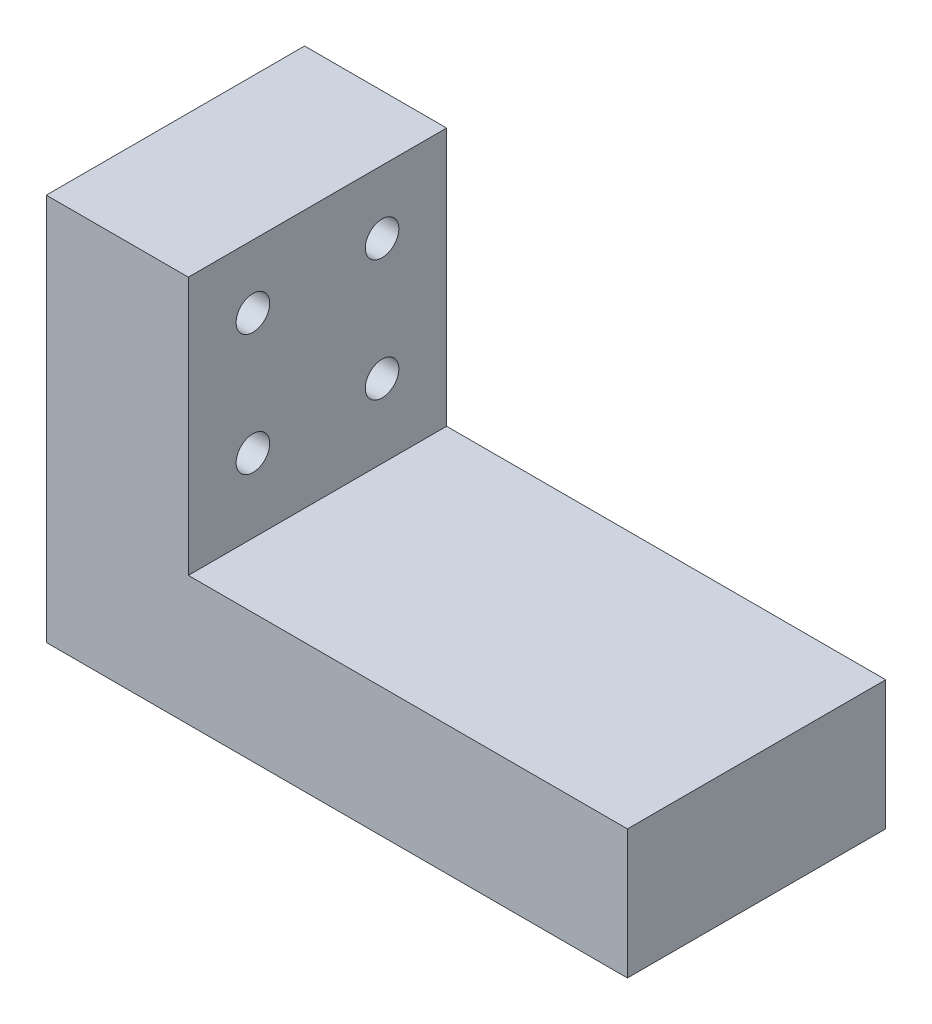
ISO-10303-21;
HEADER;
FILE_DESCRIPTION(('STEP AP214'),'2;1');
FILE_NAME('part.step','',(''),(''),'','','');
FILE_SCHEMA(('AUTOMOTIVE_DESIGN { 1 0 10303 214 1 1 1 1 }'));
ENDSEC;
DATA;
#1=APPLICATION_CONTEXT('core data for automotive mechanical design processes');
#2=APPLICATION_PROTOCOL_DEFINITION('international standard','automotive_design',2000,#1);
#3=PRODUCT_CONTEXT('',#1,'mechanical');
#4=PRODUCT('Part','Part','',(#3));
#5=PRODUCT_RELATED_PRODUCT_CATEGORY('part','',(#4));
#6=PRODUCT_DEFINITION_FORMATION('','',#4);
#7=PRODUCT_DEFINITION_CONTEXT('part definition',#1,'design');
#8=PRODUCT_DEFINITION('design','',#6,#7);
#9=PRODUCT_DEFINITION_SHAPE('','',#8);
#10=(LENGTH_UNIT() NAMED_UNIT(*) SI_UNIT(.MILLI.,.METRE.));
#11=(NAMED_UNIT(*) PLANE_ANGLE_UNIT() SI_UNIT($,.RADIAN.));
#12=(NAMED_UNIT(*) SI_UNIT($,.STERADIAN.) SOLID_ANGLE_UNIT());
#13=UNCERTAINTY_MEASURE_WITH_UNIT(LENGTH_MEASURE(1.E-05),#10,'distance_accuracy_value','');
#14=(GEOMETRIC_REPRESENTATION_CONTEXT(3) GLOBAL_UNCERTAINTY_ASSIGNED_CONTEXT((#13)) GLOBAL_UNIT_ASSIGNED_CONTEXT((#10,
#11,#12)) REPRESENTATION_CONTEXT('',''));
#15=CARTESIAN_POINT('',(0.,0.,0.));
#16=DIRECTION('',(0.,0.,1.));
#17=DIRECTION('',(1.,0.,0.));
#18=AXIS2_PLACEMENT_3D('',#15,#16,#17);
#19=CARTESIAN_POINT('',(45.,0.,20.));
#20=DIRECTION('',(0.,1.,0.));
#21=DIRECTION('',(-1.,0.,0.));
#22=AXIS2_PLACEMENT_3D('',#19,#20,#21);
#23=PLANE('',#22);
#24=CARTESIAN_POINT('',(17.5,0.,10.));
#25=DIRECTION('',(0.,-1.,0.));
#26=DIRECTION('',(1.,0.,0.));
#27=AXIS2_PLACEMENT_3D('',#24,#25,#26);
#28=CIRCLE('',#27,2.8);
#29=CARTESIAN_POINT('',(20.3,0.,10.));
#30=VERTEX_POINT('',#29);
#31=EDGE_CURVE('E163',#30,#30,#28,.T.);
#32=ORIENTED_EDGE('',*,*,#31,.F.);
#33=EDGE_LOOP('',(#32));
#34=FACE_BOUND('',#33,.T.);
#35=CARTESIAN_POINT('',(37.5,0.,10.));
#36=DIRECTION('',(0.,-1.,0.));
#37=DIRECTION('',(1.,0.,0.));
#38=AXIS2_PLACEMENT_3D('',#35,#36,#37);
#39=CIRCLE('',#38,2.80000000000001);
#40=CARTESIAN_POINT('',(40.3,0.,10.));
#41=VERTEX_POINT('',#40);
#42=EDGE_CURVE('E166',#41,#41,#39,.T.);
#43=ORIENTED_EDGE('',*,*,#42,.F.);
#44=EDGE_LOOP('',(#43));
#45=FACE_BOUND('',#44,.T.);
#46=DIRECTION('',(1.,0.,0.));
#47=VECTOR('',#46,1.);
#48=CARTESIAN_POINT('',(45.,0.,0.));
#49=LINE('',#48,#47);
#50=CARTESIAN_POINT('',(0.,0.,0.));
#51=VERTEX_POINT('',#50);
#52=CARTESIAN_POINT('',(45.,0.,0.));
#53=VERTEX_POINT('',#52);
#54=EDGE_CURVE('E117',#51,#53,#49,.T.);
#55=ORIENTED_EDGE('',*,*,#54,.T.);
#56=DIRECTION('',(0.,0.,-1.));
#57=VECTOR('',#56,1.);
#58=CARTESIAN_POINT('',(45.,0.,20.));
#59=LINE('',#58,#57);
#60=CARTESIAN_POINT('',(45.,0.,20.));
#61=VERTEX_POINT('',#60);
#62=EDGE_CURVE('E11',#61,#53,#59,.T.);
#63=ORIENTED_EDGE('',*,*,#62,.F.);
#64=DIRECTION('',(1.,0.,0.));
#65=VECTOR('',#64,1.);
#66=CARTESIAN_POINT('',(45.,0.,20.));
#67=LINE('',#66,#65);
#68=CARTESIAN_POINT('',(0.,0.,20.));
#69=VERTEX_POINT('',#68);
#70=EDGE_CURVE('E128',#69,#61,#67,.T.);
#71=ORIENTED_EDGE('',*,*,#70,.F.);
#72=DIRECTION('',(0.,0.,-1.));
#73=VECTOR('',#72,1.);
#74=CARTESIAN_POINT('',(0.,0.,20.));
#75=LINE('',#74,#73);
#76=EDGE_CURVE('E113',#69,#51,#75,.T.);
#77=ORIENTED_EDGE('',*,*,#76,.T.);
#78=EDGE_LOOP('',(#55,#63,#71,#77));
#79=FACE_BOUND('',#78,.T.);
#80=ADVANCED_FACE('F33',(#34,#45,#79),#23,.F.);
#81=CARTESIAN_POINT('',(45.,10.,20.));
#82=DIRECTION('',(-1.,0.,0.));
#83=DIRECTION('',(0.,0.,1.));
#84=AXIS2_PLACEMENT_3D('',#81,#82,#83);
#85=PLANE('',#84);
#86=DIRECTION('',(0.,1.,0.));
#87=VECTOR('',#86,1.);
#88=CARTESIAN_POINT('',(45.,10.,0.));
#89=LINE('',#88,#87);
#90=CARTESIAN_POINT('',(45.,10.,0.));
#91=VERTEX_POINT('',#90);
#92=EDGE_CURVE('E120',#53,#91,#89,.T.);
#93=ORIENTED_EDGE('',*,*,#92,.T.);
#94=DIRECTION('',(0.,0.,-1.));
#95=VECTOR('',#94,1.);
#96=CARTESIAN_POINT('',(45.,10.,20.));
#97=LINE('',#96,#95);
#98=CARTESIAN_POINT('',(45.,10.,20.));
#99=VERTEX_POINT('',#98);
#100=EDGE_CURVE('E41',#99,#91,#97,.T.);
#101=ORIENTED_EDGE('',*,*,#100,.F.);
#102=DIRECTION('',(0.,1.,0.));
#103=VECTOR('',#102,1.);
#104=CARTESIAN_POINT('',(45.,10.,20.));
#105=LINE('',#104,#103);
#106=EDGE_CURVE('E86',#61,#99,#105,.T.);
#107=ORIENTED_EDGE('',*,*,#106,.F.);
#108=ORIENTED_EDGE('',*,*,#62,.T.);
#109=EDGE_LOOP('',(#93,#101,#107,#108));
#110=FACE_BOUND('',#109,.T.);
#111=ADVANCED_FACE('F155',(#110),#85,.F.);
#112=CARTESIAN_POINT('',(11.,10.,20.));
#113=DIRECTION('',(0.,-1.,0.));
#114=DIRECTION('',(0.,0.,-1.));
#115=AXIS2_PLACEMENT_3D('',#112,#113,#114);
#116=PLANE('',#115);
#117=DIRECTION('',(-1.,0.,0.));
#118=VECTOR('',#117,1.);
#119=CARTESIAN_POINT('',(11.,10.,0.));
#120=LINE('',#119,#118);
#121=CARTESIAN_POINT('',(11.,10.,0.));
#122=VERTEX_POINT('',#121);
#123=EDGE_CURVE('E123',#91,#122,#120,.T.);
#124=ORIENTED_EDGE('',*,*,#123,.T.);
#125=DIRECTION('',(0.,0.,-1.));
#126=VECTOR('',#125,1.);
#127=CARTESIAN_POINT('',(11.,10.,20.));
#128=LINE('',#127,#126);
#129=CARTESIAN_POINT('',(11.,10.,20.));
#130=VERTEX_POINT('',#129);
#131=EDGE_CURVE('E108',#130,#122,#128,.T.);
#132=ORIENTED_EDGE('',*,*,#131,.F.);
#133=DIRECTION('',(-1.,0.,0.));
#134=VECTOR('',#133,1.);
#135=CARTESIAN_POINT('',(11.,10.,20.));
#136=LINE('',#135,#134);
#137=EDGE_CURVE('E99',#99,#130,#136,.T.);
#138=ORIENTED_EDGE('',*,*,#137,.F.);
#139=ORIENTED_EDGE('',*,*,#100,.T.);
#140=EDGE_LOOP('',(#124,#132,#138,#139));
#141=FACE_BOUND('',#140,.T.);
#142=ADVANCED_FACE('F134',(#141),#116,.F.);
#143=CARTESIAN_POINT('',(11.,30.,20.));
#144=DIRECTION('',(-1.,0.,0.));
#145=DIRECTION('',(0.,-1.,0.));
#146=AXIS2_PLACEMENT_3D('',#143,#144,#145);
#147=PLANE('',#146);
#148=CARTESIAN_POINT('',(11.,15.7,15.));
#149=DIRECTION('',(1.,0.,0.));
#150=DIRECTION('',(0.,0.,-1.));
#151=AXIS2_PLACEMENT_3D('',#148,#149,#150);
#152=CIRCLE('',#151,1.3);
#153=CARTESIAN_POINT('',(11.,15.7,13.7));
#154=VERTEX_POINT('',#153);
#155=EDGE_CURVE('E189',#154,#154,#152,.T.);
#156=ORIENTED_EDGE('',*,*,#155,.F.);
#157=EDGE_LOOP('',(#156));
#158=FACE_BOUND('',#157,.T.);
#159=CARTESIAN_POINT('',(11.,15.7,5.));
#160=DIRECTION('',(1.,0.,0.));
#161=DIRECTION('',(0.,0.,-1.));
#162=AXIS2_PLACEMENT_3D('',#159,#160,#161);
#163=CIRCLE('',#162,1.3);
#164=CARTESIAN_POINT('',(11.,15.7,3.7));
#165=VERTEX_POINT('',#164);
#166=EDGE_CURVE('E188',#165,#165,#163,.T.);
#167=ORIENTED_EDGE('',*,*,#166,.F.);
#168=EDGE_LOOP('',(#167));
#169=FACE_BOUND('',#168,.T.);
#170=CARTESIAN_POINT('',(11.,25.1,5.));
#171=DIRECTION('',(1.,0.,0.));
#172=DIRECTION('',(0.,0.,-1.));
#173=AXIS2_PLACEMENT_3D('',#170,#171,#172);
#174=CIRCLE('',#173,1.3);
#175=CARTESIAN_POINT('',(11.,25.1,3.7));
#176=VERTEX_POINT('',#175);
#177=EDGE_CURVE('E195',#176,#176,#174,.T.);
#178=ORIENTED_EDGE('',*,*,#177,.F.);
#179=EDGE_LOOP('',(#178));
#180=FACE_BOUND('',#179,.T.);
#181=CARTESIAN_POINT('',(11.,25.1,15.));
#182=DIRECTION('',(1.,0.,0.));
#183=DIRECTION('',(0.,0.,-1.));
#184=AXIS2_PLACEMENT_3D('',#181,#182,#183);
#185=CIRCLE('',#184,1.3);
#186=CARTESIAN_POINT('',(11.,25.1,13.7));
#187=VERTEX_POINT('',#186);
#188=EDGE_CURVE('E174',#187,#187,#185,.T.);
#189=ORIENTED_EDGE('',*,*,#188,.F.);
#190=EDGE_LOOP('',(#189));
#191=FACE_BOUND('',#190,.T.);
#192=DIRECTION('',(0.,1.,0.));
#193=VECTOR('',#192,1.);
#194=CARTESIAN_POINT('',(11.,30.,0.));
#195=LINE('',#194,#193);
#196=CARTESIAN_POINT('',(11.,30.,0.));
#197=VERTEX_POINT('',#196);
#198=EDGE_CURVE('E107',#122,#197,#195,.T.);
#199=ORIENTED_EDGE('',*,*,#198,.T.);
#200=DIRECTION('',(0.,0.,-1.));
#201=VECTOR('',#200,1.);
#202=CARTESIAN_POINT('',(11.,30.,20.));
#203=LINE('',#202,#201);
#204=CARTESIAN_POINT('',(11.,30.,20.));
#205=VERTEX_POINT('',#204);
#206=EDGE_CURVE('E104',#205,#197,#203,.T.);
#207=ORIENTED_EDGE('',*,*,#206,.F.);
#208=DIRECTION('',(0.,1.,0.));
#209=VECTOR('',#208,1.);
#210=CARTESIAN_POINT('',(11.,30.,20.));
#211=LINE('',#210,#209);
#212=EDGE_CURVE('E93',#130,#205,#211,.T.);
#213=ORIENTED_EDGE('',*,*,#212,.F.);
#214=ORIENTED_EDGE('',*,*,#131,.T.);
#215=EDGE_LOOP('',(#199,#207,#213,#214));
#216=FACE_BOUND('',#215,.T.);
#217=ADVANCED_FACE('F105',(#158,#169,#180,#191,#216),#147,.F.);
#218=CARTESIAN_POINT('',(0.,30.,20.));
#219=DIRECTION('',(0.,-1.,0.));
#220=DIRECTION('',(0.,0.,-1.));
#221=AXIS2_PLACEMENT_3D('',#218,#219,#220);
#222=PLANE('',#221);
#223=DIRECTION('',(-1.,0.,0.));
#224=VECTOR('',#223,1.);
#225=CARTESIAN_POINT('',(0.,30.,0.));
#226=LINE('',#225,#224);
#227=CARTESIAN_POINT('',(0.,30.,0.));
#228=VERTEX_POINT('',#227);
#229=EDGE_CURVE('E72',#197,#228,#226,.T.);
#230=ORIENTED_EDGE('',*,*,#229,.T.);
#231=DIRECTION('',(0.,0.,-1.));
#232=VECTOR('',#231,1.);
#233=CARTESIAN_POINT('',(0.,30.,20.));
#234=LINE('',#233,#232);
#235=CARTESIAN_POINT('',(0.,30.,20.));
#236=VERTEX_POINT('',#235);
#237=EDGE_CURVE('E109',#236,#228,#234,.T.);
#238=ORIENTED_EDGE('',*,*,#237,.F.);
#239=DIRECTION('',(-1.,0.,0.));
#240=VECTOR('',#239,1.);
#241=CARTESIAN_POINT('',(0.,30.,20.));
#242=LINE('',#241,#240);
#243=EDGE_CURVE('E97',#205,#236,#242,.T.);
#244=ORIENTED_EDGE('',*,*,#243,.F.);
#245=ORIENTED_EDGE('',*,*,#206,.T.);
#246=EDGE_LOOP('',(#230,#238,#244,#245));
#247=FACE_BOUND('',#246,.T.);
#248=ADVANCED_FACE('F111',(#247),#222,.F.);
#249=CARTESIAN_POINT('',(0.,0.,20.));
#250=DIRECTION('',(1.,0.,0.));
#251=DIRECTION('',(0.,0.,-1.));
#252=AXIS2_PLACEMENT_3D('',#249,#250,#251);
#253=PLANE('',#252);
#254=CARTESIAN_POINT('',(0.,15.7,15.));
#255=DIRECTION('',(1.,0.,0.));
#256=DIRECTION('',(0.,0.,-1.));
#257=AXIS2_PLACEMENT_3D('',#254,#255,#256);
#258=CIRCLE('',#257,1.3);
#259=CARTESIAN_POINT('',(0.,15.7,13.7));
#260=VERTEX_POINT('',#259);
#261=EDGE_CURVE('E185',#260,#260,#258,.F.);
#262=ORIENTED_EDGE('',*,*,#261,.F.);
#263=EDGE_LOOP('',(#262));
#264=FACE_BOUND('',#263,.T.);
#265=CARTESIAN_POINT('',(0.,15.7,5.));
#266=DIRECTION('',(1.,0.,0.));
#267=DIRECTION('',(0.,0.,-1.));
#268=AXIS2_PLACEMENT_3D('',#265,#266,#267);
#269=CIRCLE('',#268,1.3);
#270=CARTESIAN_POINT('',(0.,15.7,3.7));
#271=VERTEX_POINT('',#270);
#272=EDGE_CURVE('E192',#271,#271,#269,.F.);
#273=ORIENTED_EDGE('',*,*,#272,.F.);
#274=EDGE_LOOP('',(#273));
#275=FACE_BOUND('',#274,.T.);
#276=CARTESIAN_POINT('',(0.,25.1,5.));
#277=DIRECTION('',(1.,0.,0.));
#278=DIRECTION('',(0.,0.,-1.));
#279=AXIS2_PLACEMENT_3D('',#276,#277,#278);
#280=CIRCLE('',#279,1.3);
#281=CARTESIAN_POINT('',(0.,25.1,3.7));
#282=VERTEX_POINT('',#281);
#283=EDGE_CURVE('E184',#282,#282,#280,.F.);
#284=ORIENTED_EDGE('',*,*,#283,.F.);
#285=EDGE_LOOP('',(#284));
#286=FACE_BOUND('',#285,.T.);
#287=CARTESIAN_POINT('',(0.,25.1,15.));
#288=DIRECTION('',(1.,0.,0.));
#289=DIRECTION('',(0.,0.,-1.));
#290=AXIS2_PLACEMENT_3D('',#287,#288,#289);
#291=CIRCLE('',#290,1.3);
#292=CARTESIAN_POINT('',(0.,25.1,13.7));
#293=VERTEX_POINT('',#292);
#294=EDGE_CURVE('E169',#293,#293,#291,.F.);
#295=ORIENTED_EDGE('',*,*,#294,.F.);
#296=EDGE_LOOP('',(#295));
#297=FACE_BOUND('',#296,.T.);
#298=DIRECTION('',(0.,-1.,0.));
#299=VECTOR('',#298,1.);
#300=CARTESIAN_POINT('',(0.,0.,0.));
#301=LINE('',#300,#299);
#302=EDGE_CURVE('E78',#228,#51,#301,.T.);
#303=ORIENTED_EDGE('',*,*,#302,.T.);
#304=ORIENTED_EDGE('',*,*,#76,.F.);
#305=DIRECTION('',(0.,-1.,0.));
#306=VECTOR('',#305,1.);
#307=CARTESIAN_POINT('',(0.,0.,20.));
#308=LINE('',#307,#306);
#309=EDGE_CURVE('E49',#236,#69,#308,.T.);
#310=ORIENTED_EDGE('',*,*,#309,.F.);
#311=ORIENTED_EDGE('',*,*,#237,.T.);
#312=EDGE_LOOP('',(#303,#304,#310,#311));
#313=FACE_BOUND('',#312,.T.);
#314=ADVANCED_FACE('F141',(#264,#275,#286,#297,#313),#253,.F.);
#315=CARTESIAN_POINT('',(0.,0.,20.));
#316=DIRECTION('',(0.,0.,-1.));
#317=DIRECTION('',(-1.,0.,0.));
#318=AXIS2_PLACEMENT_3D('',#315,#316,#317);
#319=PLANE('',#318);
#320=ORIENTED_EDGE('',*,*,#70,.T.);
#321=ORIENTED_EDGE('',*,*,#106,.T.);
#322=ORIENTED_EDGE('',*,*,#137,.T.);
#323=ORIENTED_EDGE('',*,*,#212,.T.);
#324=ORIENTED_EDGE('',*,*,#243,.T.);
#325=ORIENTED_EDGE('',*,*,#309,.T.);
#326=EDGE_LOOP('',(#320,#321,#322,#323,#324,#325));
#327=FACE_BOUND('',#326,.T.);
#328=ADVANCED_FACE('F95',(#327),#319,.F.);
#329=CARTESIAN_POINT('',(0.,0.,0.));
#330=DIRECTION('',(0.,0.,-1.));
#331=DIRECTION('',(-1.,0.,0.));
#332=AXIS2_PLACEMENT_3D('',#329,#330,#331);
#333=PLANE('',#332);
#334=ORIENTED_EDGE('',*,*,#54,.F.);
#335=ORIENTED_EDGE('',*,*,#302,.F.);
#336=ORIENTED_EDGE('',*,*,#229,.F.);
#337=ORIENTED_EDGE('',*,*,#198,.F.);
#338=ORIENTED_EDGE('',*,*,#123,.F.);
#339=ORIENTED_EDGE('',*,*,#92,.F.);
#340=EDGE_LOOP('',(#334,#335,#336,#337,#338,#339));
#341=FACE_BOUND('',#340,.T.);
#342=ADVANCED_FACE('F137',(#341),#333,.T.);
#343=CARTESIAN_POINT('',(37.5,8.09999999999999,10.));
#344=DIRECTION('',(0.,-1.,0.));
#345=DIRECTION('',(1.,0.,0.));
#346=AXIS2_PLACEMENT_3D('',#343,#344,#345);
#347=CYLINDRICAL_SURFACE('',#346,2.80000000000001);
#348=CARTESIAN_POINT('',(37.5,8.09999999999999,10.));
#349=DIRECTION('',(0.,-1.,0.));
#350=DIRECTION('',(1.,0.,0.));
#351=AXIS2_PLACEMENT_3D('',#348,#349,#350);
#352=CIRCLE('',#351,2.80000000000001);
#353=CARTESIAN_POINT('',(40.3,8.09999999999999,10.));
#354=VERTEX_POINT('',#353);
#355=EDGE_CURVE('E168',#354,#354,#352,.T.);
#356=ORIENTED_EDGE('',*,*,#355,.F.);
#357=EDGE_LOOP('',(#356));
#358=FACE_BOUND('',#357,.T.);
#359=ORIENTED_EDGE('',*,*,#42,.T.);
#360=EDGE_LOOP('',(#359));
#361=FACE_BOUND('',#360,.T.);
#362=ADVANCED_FACE('F238',(#358,#361),#347,.F.);
#363=CARTESIAN_POINT('',(37.5,8.09999999999999,10.));
#364=DIRECTION('',(0.,-1.,0.));
#365=DIRECTION('',(1.,0.,0.));
#366=AXIS2_PLACEMENT_3D('',#363,#364,#365);
#367=PLANE('',#366);
#368=ORIENTED_EDGE('',*,*,#355,.T.);
#369=EDGE_LOOP('',(#368));
#370=FACE_BOUND('',#369,.T.);
#371=ADVANCED_FACE('F234',(#370),#367,.T.);
#372=CARTESIAN_POINT('',(17.5,8.09999999999999,10.));
#373=DIRECTION('',(0.,-1.,0.));
#374=DIRECTION('',(1.,0.,0.));
#375=AXIS2_PLACEMENT_3D('',#372,#373,#374);
#376=CYLINDRICAL_SURFACE('',#375,2.8);
#377=CARTESIAN_POINT('',(17.5,8.09999999999999,10.));
#378=DIRECTION('',(0.,-1.,0.));
#379=DIRECTION('',(1.,0.,0.));
#380=AXIS2_PLACEMENT_3D('',#377,#378,#379);
#381=CIRCLE('',#380,2.8);
#382=CARTESIAN_POINT('',(20.3,8.09999999999999,10.));
#383=VERTEX_POINT('',#382);
#384=EDGE_CURVE('E121',#383,#383,#381,.T.);
#385=ORIENTED_EDGE('',*,*,#384,.F.);
#386=EDGE_LOOP('',(#385));
#387=FACE_BOUND('',#386,.T.);
#388=ORIENTED_EDGE('',*,*,#31,.T.);
#389=EDGE_LOOP('',(#388));
#390=FACE_BOUND('',#389,.T.);
#391=ADVANCED_FACE('F225',(#387,#390),#376,.F.);
#392=CARTESIAN_POINT('',(17.5,8.09999999999999,10.));
#393=DIRECTION('',(0.,-1.,0.));
#394=DIRECTION('',(1.,0.,0.));
#395=AXIS2_PLACEMENT_3D('',#392,#393,#394);
#396=PLANE('',#395);
#397=ORIENTED_EDGE('',*,*,#384,.T.);
#398=EDGE_LOOP('',(#397));
#399=FACE_BOUND('',#398,.T.);
#400=ADVANCED_FACE('F215',(#399),#396,.T.);
#401=CARTESIAN_POINT('',(-0.000999999999999265,25.1,15.));
#402=DIRECTION('',(1.,0.,0.));
#403=DIRECTION('',(0.,0.,-1.));
#404=AXIS2_PLACEMENT_3D('',#401,#402,#403);
#405=CYLINDRICAL_SURFACE('',#404,1.3);
#406=ORIENTED_EDGE('',*,*,#188,.T.);
#407=EDGE_LOOP('',(#406));
#408=FACE_BOUND('',#407,.T.);
#409=ORIENTED_EDGE('',*,*,#294,.T.);
#410=EDGE_LOOP('',(#409));
#411=FACE_BOUND('',#410,.T.);
#412=ADVANCED_FACE('F212',(#408,#411),#405,.F.);
#413=CARTESIAN_POINT('',(-0.000999999999999265,25.1,5.));
#414=DIRECTION('',(1.,0.,0.));
#415=DIRECTION('',(0.,0.,-1.));
#416=AXIS2_PLACEMENT_3D('',#413,#414,#415);
#417=CYLINDRICAL_SURFACE('',#416,1.3);
#418=ORIENTED_EDGE('',*,*,#177,.T.);
#419=EDGE_LOOP('',(#418));
#420=FACE_BOUND('',#419,.T.);
#421=ORIENTED_EDGE('',*,*,#283,.T.);
#422=EDGE_LOOP('',(#421));
#423=FACE_BOUND('',#422,.T.);
#424=ADVANCED_FACE('F203',(#420,#423),#417,.F.);
#425=CARTESIAN_POINT('',(-0.000999999999999265,15.7,5.));
#426=DIRECTION('',(1.,0.,0.));
#427=DIRECTION('',(0.,0.,-1.));
#428=AXIS2_PLACEMENT_3D('',#425,#426,#427);
#429=CYLINDRICAL_SURFACE('',#428,1.3);
#430=ORIENTED_EDGE('',*,*,#166,.T.);
#431=EDGE_LOOP('',(#430));
#432=FACE_BOUND('',#431,.T.);
#433=ORIENTED_EDGE('',*,*,#272,.T.);
#434=EDGE_LOOP('',(#433));
#435=FACE_BOUND('',#434,.T.);
#436=ADVANCED_FACE('F223',(#432,#435),#429,.F.);
#437=CARTESIAN_POINT('',(-0.000999999999999265,15.7,15.));
#438=DIRECTION('',(1.,0.,0.));
#439=DIRECTION('',(0.,0.,-1.));
#440=AXIS2_PLACEMENT_3D('',#437,#438,#439);
#441=CYLINDRICAL_SURFACE('',#440,1.3);
#442=ORIENTED_EDGE('',*,*,#155,.T.);
#443=EDGE_LOOP('',(#442));
#444=FACE_BOUND('',#443,.T.);
#445=ORIENTED_EDGE('',*,*,#261,.T.);
#446=EDGE_LOOP('',(#445));
#447=FACE_BOUND('',#446,.T.);
#448=ADVANCED_FACE('F229',(#444,#447),#441,.F.);
#449=CLOSED_SHELL('',(#80,#111,#142,#217,#248,#314,#328,#342,#362,#371,#391,#400,#412,#424,#436,#448));
#450=MANIFOLD_SOLID_BREP('B2',#449);
#451=ADVANCED_BREP_SHAPE_REPRESENTATION('',(#18,#450),#14);
#452=SHAPE_DEFINITION_REPRESENTATION(#9,#451);
ENDSEC;
END-ISO-10303-21;
